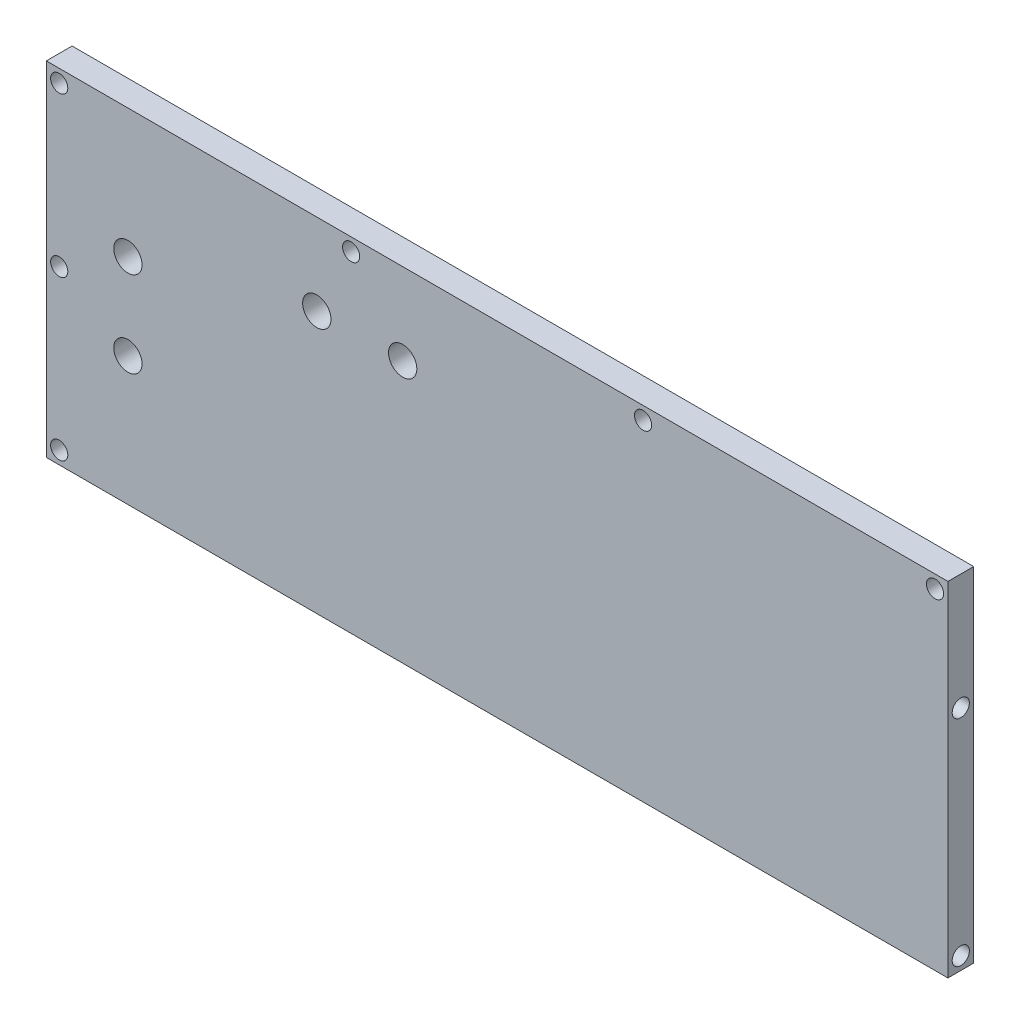
ISO-10303-21;
HEADER;
FILE_DESCRIPTION(('STEP AP214'),'2;1');
FILE_NAME('part.step','',(''),(''),'','','');
FILE_SCHEMA(('AUTOMOTIVE_DESIGN { 1 0 10303 214 1 1 1 1 }'));
ENDSEC;
DATA;
#1=APPLICATION_CONTEXT('core data for automotive mechanical design processes');
#2=APPLICATION_PROTOCOL_DEFINITION('international standard','automotive_design',2000,#1);
#3=PRODUCT_CONTEXT('',#1,'mechanical');
#4=PRODUCT('Part','Part','',(#3));
#5=PRODUCT_RELATED_PRODUCT_CATEGORY('part','',(#4));
#6=PRODUCT_DEFINITION_FORMATION('','',#4);
#7=PRODUCT_DEFINITION_CONTEXT('part definition',#1,'design');
#8=PRODUCT_DEFINITION('design','',#6,#7);
#9=PRODUCT_DEFINITION_SHAPE('','',#8);
#10=(LENGTH_UNIT() NAMED_UNIT(*) SI_UNIT(.MILLI.,.METRE.));
#11=(NAMED_UNIT(*) PLANE_ANGLE_UNIT() SI_UNIT($,.RADIAN.));
#12=(NAMED_UNIT(*) SI_UNIT($,.STERADIAN.) SOLID_ANGLE_UNIT());
#13=UNCERTAINTY_MEASURE_WITH_UNIT(LENGTH_MEASURE(1.E-05),#10,'distance_accuracy_value','');
#14=(GEOMETRIC_REPRESENTATION_CONTEXT(3) GLOBAL_UNCERTAINTY_ASSIGNED_CONTEXT((#13)) GLOBAL_UNIT_ASSIGNED_CONTEXT((#10,
#11,#12)) REPRESENTATION_CONTEXT('',''));
#15=CARTESIAN_POINT('',(0.,0.,0.));
#16=DIRECTION('',(0.,0.,1.));
#17=DIRECTION('',(1.,0.,0.));
#18=AXIS2_PLACEMENT_3D('',#15,#16,#17);
#19=CARTESIAN_POINT('',(-105.,-40.,6.));
#20=DIRECTION('',(1.,0.,0.));
#21=DIRECTION('',(0.,0.,-1.));
#22=AXIS2_PLACEMENT_3D('',#19,#20,#21);
#23=PLANE('',#22);
#24=DIRECTION('',(0.,-1.,0.));
#25=VECTOR('',#24,1.);
#26=CARTESIAN_POINT('',(-105.,-40.,0.));
#27=LINE('',#26,#25);
#28=CARTESIAN_POINT('',(-105.,40.,0.));
#29=VERTEX_POINT('',#28);
#30=CARTESIAN_POINT('',(-105.,-40.,0.));
#31=VERTEX_POINT('',#30);
#32=EDGE_CURVE('E100',#29,#31,#27,.T.);
#33=ORIENTED_EDGE('',*,*,#32,.T.);
#34=DIRECTION('',(0.,0.,-1.));
#35=VECTOR('',#34,1.);
#36=CARTESIAN_POINT('',(-105.,-40.,6.));
#37=LINE('',#36,#35);
#38=CARTESIAN_POINT('',(-105.,-40.,6.));
#39=VERTEX_POINT('',#38);
#40=EDGE_CURVE('E11',#39,#31,#37,.T.);
#41=ORIENTED_EDGE('',*,*,#40,.F.);
#42=DIRECTION('',(0.,-1.,0.));
#43=VECTOR('',#42,1.);
#44=CARTESIAN_POINT('',(-105.,-40.,6.));
#45=LINE('',#44,#43);
#46=CARTESIAN_POINT('',(-105.,40.,6.));
#47=VERTEX_POINT('',#46);
#48=EDGE_CURVE('E87',#47,#39,#45,.T.);
#49=ORIENTED_EDGE('',*,*,#48,.F.);
#50=DIRECTION('',(0.,0.,-1.));
#51=VECTOR('',#50,1.);
#52=CARTESIAN_POINT('',(-105.,40.,6.));
#53=LINE('',#52,#51);
#54=EDGE_CURVE('E96',#47,#29,#53,.T.);
#55=ORIENTED_EDGE('',*,*,#54,.T.);
#56=EDGE_LOOP('',(#33,#41,#49,#55));
#57=FACE_BOUND('',#56,.T.);
#58=ADVANCED_FACE('F34',(#57),#23,.F.);
#59=CARTESIAN_POINT('',(-105.,-40.,6.));
#60=DIRECTION('',(0.,1.,0.));
#61=DIRECTION('',(0.,0.,1.));
#62=AXIS2_PLACEMENT_3D('',#59,#60,#61);
#63=PLANE('',#62);
#64=DIRECTION('',(1.,0.,0.));
#65=VECTOR('',#64,1.);
#66=CARTESIAN_POINT('',(-105.,-40.,0.));
#67=LINE('',#66,#65);
#68=CARTESIAN_POINT('',(105.,-40.,0.));
#69=VERTEX_POINT('',#68);
#70=EDGE_CURVE('E91',#31,#69,#67,.T.);
#71=ORIENTED_EDGE('',*,*,#70,.T.);
#72=DIRECTION('',(0.,0.,-1.));
#73=VECTOR('',#72,1.);
#74=CARTESIAN_POINT('',(105.,-40.,6.));
#75=LINE('',#74,#73);
#76=CARTESIAN_POINT('',(105.,-40.,6.));
#77=VERTEX_POINT('',#76);
#78=EDGE_CURVE('E43',#77,#69,#75,.T.);
#79=ORIENTED_EDGE('',*,*,#78,.F.);
#80=DIRECTION('',(1.,0.,0.));
#81=VECTOR('',#80,1.);
#82=CARTESIAN_POINT('',(-105.,-40.,6.));
#83=LINE('',#82,#81);
#84=EDGE_CURVE('E82',#39,#77,#83,.T.);
#85=ORIENTED_EDGE('',*,*,#84,.F.);
#86=ORIENTED_EDGE('',*,*,#40,.T.);
#87=EDGE_LOOP('',(#71,#79,#85,#86));
#88=FACE_BOUND('',#87,.T.);
#89=ADVANCED_FACE('F90',(#88),#63,.F.);
#90=CARTESIAN_POINT('',(105.,-40.,6.));
#91=DIRECTION('',(-1.,0.,0.));
#92=DIRECTION('',(0.,-1.,0.));
#93=AXIS2_PLACEMENT_3D('',#90,#91,#92);
#94=PLANE('',#93);
#95=CARTESIAN_POINT('',(105.,13.,3.));
#96=DIRECTION('',(1.,0.,0.));
#97=DIRECTION('',(0.,1.,0.));
#98=AXIS2_PLACEMENT_3D('',#95,#96,#97);
#99=CIRCLE('',#98,2.);
#100=CARTESIAN_POINT('',(105.,15.,3.));
#101=VERTEX_POINT('',#100);
#102=EDGE_CURVE('E112',#101,#101,#99,.T.);
#103=ORIENTED_EDGE('',*,*,#102,.F.);
#104=EDGE_LOOP('',(#103));
#105=FACE_BOUND('',#104,.T.);
#106=CARTESIAN_POINT('',(105.,-37.,3.));
#107=DIRECTION('',(1.,0.,0.));
#108=DIRECTION('',(0.,1.,0.));
#109=AXIS2_PLACEMENT_3D('',#106,#107,#108);
#110=CIRCLE('',#109,2.);
#111=CARTESIAN_POINT('',(105.,-35.,3.));
#112=VERTEX_POINT('',#111);
#113=EDGE_CURVE('E137',#112,#112,#110,.T.);
#114=ORIENTED_EDGE('',*,*,#113,.F.);
#115=EDGE_LOOP('',(#114));
#116=FACE_BOUND('',#115,.T.);
#117=DIRECTION('',(0.,1.,0.));
#118=VECTOR('',#117,1.);
#119=CARTESIAN_POINT('',(105.,-40.,0.));
#120=LINE('',#119,#118);
#121=CARTESIAN_POINT('',(105.,40.,0.));
#122=VERTEX_POINT('',#121);
#123=EDGE_CURVE('E69',#69,#122,#120,.T.);
#124=ORIENTED_EDGE('',*,*,#123,.T.);
#125=DIRECTION('',(0.,0.,-1.));
#126=VECTOR('',#125,1.);
#127=CARTESIAN_POINT('',(105.,40.,6.));
#128=LINE('',#127,#126);
#129=CARTESIAN_POINT('',(105.,40.,6.));
#130=VERTEX_POINT('',#129);
#131=EDGE_CURVE('E92',#130,#122,#128,.T.);
#132=ORIENTED_EDGE('',*,*,#131,.F.);
#133=DIRECTION('',(0.,1.,0.));
#134=VECTOR('',#133,1.);
#135=CARTESIAN_POINT('',(105.,-40.,6.));
#136=LINE('',#135,#134);
#137=EDGE_CURVE('E85',#77,#130,#136,.T.);
#138=ORIENTED_EDGE('',*,*,#137,.F.);
#139=ORIENTED_EDGE('',*,*,#78,.T.);
#140=EDGE_LOOP('',(#124,#132,#138,#139));
#141=FACE_BOUND('',#140,.T.);
#142=ADVANCED_FACE('F94',(#105,#116,#141),#94,.F.);
#143=CARTESIAN_POINT('',(-105.,40.,6.));
#144=DIRECTION('',(0.,-1.,0.));
#145=DIRECTION('',(0.,0.,-1.));
#146=AXIS2_PLACEMENT_3D('',#143,#144,#145);
#147=PLANE('',#146);
#148=DIRECTION('',(-1.,0.,0.));
#149=VECTOR('',#148,1.);
#150=CARTESIAN_POINT('',(-105.,40.,0.));
#151=LINE('',#150,#149);
#152=EDGE_CURVE('E75',#122,#29,#151,.T.);
#153=ORIENTED_EDGE('',*,*,#152,.T.);
#154=ORIENTED_EDGE('',*,*,#54,.F.);
#155=DIRECTION('',(-1.,0.,0.));
#156=VECTOR('',#155,1.);
#157=CARTESIAN_POINT('',(-105.,40.,6.));
#158=LINE('',#157,#156);
#159=EDGE_CURVE('E52',#130,#47,#158,.T.);
#160=ORIENTED_EDGE('',*,*,#159,.F.);
#161=ORIENTED_EDGE('',*,*,#131,.T.);
#162=EDGE_LOOP('',(#153,#154,#160,#161));
#163=FACE_BOUND('',#162,.T.);
#164=ADVANCED_FACE('F185',(#163),#147,.F.);
#165=CARTESIAN_POINT('',(0.,0.,6.));
#166=DIRECTION('',(0.,0.,-1.));
#167=DIRECTION('',(-1.,0.,0.));
#168=AXIS2_PLACEMENT_3D('',#165,#166,#167);
#169=PLANE('',#168);
#170=CARTESIAN_POINT('',(-22.,21.,6.));
#171=DIRECTION('',(0.,0.,1.));
#172=DIRECTION('',(-1.,0.,0.));
#173=AXIS2_PLACEMENT_3D('',#170,#171,#172);
#174=CIRCLE('',#173,3.3);
#175=CARTESIAN_POINT('',(-25.3,21.,6.));
#176=VERTEX_POINT('',#175);
#177=EDGE_CURVE('E129',#176,#176,#174,.T.);
#178=ORIENTED_EDGE('',*,*,#177,.F.);
#179=EDGE_LOOP('',(#178));
#180=FACE_BOUND('',#179,.T.);
#181=CARTESIAN_POINT('',(-42.,21.,6.));
#182=DIRECTION('',(0.,0.,1.));
#183=DIRECTION('',(1.,0.,0.));
#184=AXIS2_PLACEMENT_3D('',#181,#182,#183);
#185=CIRCLE('',#184,3.3);
#186=CARTESIAN_POINT('',(-38.7,21.,6.));
#187=VERTEX_POINT('',#186);
#188=EDGE_CURVE('E119',#187,#187,#185,.T.);
#189=ORIENTED_EDGE('',*,*,#188,.F.);
#190=EDGE_LOOP('',(#189));
#191=FACE_BOUND('',#190,.T.);
#192=CARTESIAN_POINT('',(-86.,-10.,6.));
#193=DIRECTION('',(0.,0.,1.));
#194=DIRECTION('',(-1.,0.,0.));
#195=AXIS2_PLACEMENT_3D('',#192,#193,#194);
#196=CIRCLE('',#195,3.30000000000001);
#197=CARTESIAN_POINT('',(-89.3,-10.,6.));
#198=VERTEX_POINT('',#197);
#199=EDGE_CURVE('E116',#198,#198,#196,.T.);
#200=ORIENTED_EDGE('',*,*,#199,.F.);
#201=EDGE_LOOP('',(#200));
#202=FACE_BOUND('',#201,.T.);
#203=CARTESIAN_POINT('',(-86.,9.99999999999999,6.));
#204=DIRECTION('',(0.,0.,1.));
#205=DIRECTION('',(1.,0.,0.));
#206=AXIS2_PLACEMENT_3D('',#203,#204,#205);
#207=CIRCLE('',#206,3.30000000000001);
#208=CARTESIAN_POINT('',(-82.7,9.99999999999999,6.));
#209=VERTEX_POINT('',#208);
#210=EDGE_CURVE('E113',#209,#209,#207,.T.);
#211=ORIENTED_EDGE('',*,*,#210,.F.);
#212=EDGE_LOOP('',(#211));
#213=FACE_BOUND('',#212,.T.);
#214=CARTESIAN_POINT('',(102.,37.,6.));
#215=DIRECTION('',(0.,0.,1.));
#216=DIRECTION('',(1.,0.,0.));
#217=AXIS2_PLACEMENT_3D('',#214,#215,#216);
#218=CIRCLE('',#217,2.);
#219=CARTESIAN_POINT('',(104.,37.,6.));
#220=VERTEX_POINT('',#219);
#221=EDGE_CURVE('E143',#220,#220,#218,.T.);
#222=ORIENTED_EDGE('',*,*,#221,.F.);
#223=EDGE_LOOP('',(#222));
#224=FACE_BOUND('',#223,.T.);
#225=CARTESIAN_POINT('',(34.,37.,6.));
#226=DIRECTION('',(0.,0.,1.));
#227=DIRECTION('',(1.,0.,0.));
#228=AXIS2_PLACEMENT_3D('',#225,#226,#227);
#229=CIRCLE('',#228,2.);
#230=CARTESIAN_POINT('',(36.,37.,6.));
#231=VERTEX_POINT('',#230);
#232=EDGE_CURVE('E149',#231,#231,#229,.T.);
#233=ORIENTED_EDGE('',*,*,#232,.F.);
#234=EDGE_LOOP('',(#233));
#235=FACE_BOUND('',#234,.T.);
#236=CARTESIAN_POINT('',(-34.,37.,6.));
#237=DIRECTION('',(0.,0.,1.));
#238=DIRECTION('',(1.,0.,0.));
#239=AXIS2_PLACEMENT_3D('',#236,#237,#238);
#240=CIRCLE('',#239,2.);
#241=CARTESIAN_POINT('',(-32.,37.,6.));
#242=VERTEX_POINT('',#241);
#243=EDGE_CURVE('E155',#242,#242,#240,.T.);
#244=ORIENTED_EDGE('',*,*,#243,.F.);
#245=EDGE_LOOP('',(#244));
#246=FACE_BOUND('',#245,.T.);
#247=CARTESIAN_POINT('',(-102.,-37.,6.));
#248=DIRECTION('',(0.,0.,1.));
#249=DIRECTION('',(-1.,0.,0.));
#250=AXIS2_PLACEMENT_3D('',#247,#248,#249);
#251=CIRCLE('',#250,2.);
#252=CARTESIAN_POINT('',(-104.,-37.,6.));
#253=VERTEX_POINT('',#252);
#254=EDGE_CURVE('E161',#253,#253,#251,.T.);
#255=ORIENTED_EDGE('',*,*,#254,.F.);
#256=EDGE_LOOP('',(#255));
#257=FACE_BOUND('',#256,.T.);
#258=CARTESIAN_POINT('',(-102.,37.,6.));
#259=DIRECTION('',(0.,0.,1.));
#260=DIRECTION('',(1.,0.,0.));
#261=AXIS2_PLACEMENT_3D('',#258,#259,#260);
#262=CIRCLE('',#261,2.);
#263=CARTESIAN_POINT('',(-100.,37.,6.));
#264=VERTEX_POINT('',#263);
#265=EDGE_CURVE('E167',#264,#264,#262,.T.);
#266=ORIENTED_EDGE('',*,*,#265,.F.);
#267=EDGE_LOOP('',(#266));
#268=FACE_BOUND('',#267,.T.);
#269=CARTESIAN_POINT('',(-102.,0.,6.));
#270=DIRECTION('',(0.,0.,1.));
#271=DIRECTION('',(1.,0.,0.));
#272=AXIS2_PLACEMENT_3D('',#269,#270,#271);
#273=CIRCLE('',#272,2.);
#274=CARTESIAN_POINT('',(-100.,0.,6.));
#275=VERTEX_POINT('',#274);
#276=EDGE_CURVE('E173',#275,#275,#273,.T.);
#277=ORIENTED_EDGE('',*,*,#276,.F.);
#278=EDGE_LOOP('',(#277));
#279=FACE_BOUND('',#278,.T.);
#280=ORIENTED_EDGE('',*,*,#48,.T.);
#281=ORIENTED_EDGE('',*,*,#84,.T.);
#282=ORIENTED_EDGE('',*,*,#137,.T.);
#283=ORIENTED_EDGE('',*,*,#159,.T.);
#284=EDGE_LOOP('',(#280,#281,#282,#283));
#285=FACE_BOUND('',#284,.T.);
#286=ADVANCED_FACE('F83',(#180,#191,#202,#213,#224,#235,#246,#257,#268,#279,#285),#169,.F.);
#287=CARTESIAN_POINT('',(0.,0.,0.));
#288=DIRECTION('',(0.,0.,-1.));
#289=DIRECTION('',(-1.,0.,0.));
#290=AXIS2_PLACEMENT_3D('',#287,#288,#289);
#291=PLANE('',#290);
#292=CARTESIAN_POINT('',(-22.,21.,0.));
#293=DIRECTION('',(0.,0.,-1.));
#294=DIRECTION('',(-1.,0.,0.));
#295=AXIS2_PLACEMENT_3D('',#292,#293,#294);
#296=CIRCLE('',#295,3.3);
#297=CARTESIAN_POINT('',(-25.3,21.,0.));
#298=VERTEX_POINT('',#297);
#299=EDGE_CURVE('E37',#298,#298,#296,.T.);
#300=ORIENTED_EDGE('',*,*,#299,.F.);
#301=EDGE_LOOP('',(#300));
#302=FACE_BOUND('',#301,.T.);
#303=CARTESIAN_POINT('',(-42.,21.,0.));
#304=DIRECTION('',(0.,0.,-1.));
#305=DIRECTION('',(-1.,0.,0.));
#306=AXIS2_PLACEMENT_3D('',#303,#304,#305);
#307=CIRCLE('',#306,3.3);
#308=CARTESIAN_POINT('',(-45.3,21.,0.));
#309=VERTEX_POINT('',#308);
#310=EDGE_CURVE('E117',#309,#309,#307,.T.);
#311=ORIENTED_EDGE('',*,*,#310,.F.);
#312=EDGE_LOOP('',(#311));
#313=FACE_BOUND('',#312,.T.);
#314=CARTESIAN_POINT('',(-86.,-10.,0.));
#315=DIRECTION('',(0.,0.,-1.));
#316=DIRECTION('',(-1.,0.,0.));
#317=AXIS2_PLACEMENT_3D('',#314,#315,#316);
#318=CIRCLE('',#317,3.30000000000001);
#319=CARTESIAN_POINT('',(-89.3,-10.,0.));
#320=VERTEX_POINT('',#319);
#321=EDGE_CURVE('E114',#320,#320,#318,.T.);
#322=ORIENTED_EDGE('',*,*,#321,.F.);
#323=EDGE_LOOP('',(#322));
#324=FACE_BOUND('',#323,.T.);
#325=CARTESIAN_POINT('',(-86.,9.99999999999999,0.));
#326=DIRECTION('',(0.,0.,-1.));
#327=DIRECTION('',(-1.,0.,0.));
#328=AXIS2_PLACEMENT_3D('',#325,#326,#327);
#329=CIRCLE('',#328,3.30000000000001);
#330=CARTESIAN_POINT('',(-89.3,9.99999999999999,0.));
#331=VERTEX_POINT('',#330);
#332=EDGE_CURVE('E109',#331,#331,#329,.T.);
#333=ORIENTED_EDGE('',*,*,#332,.F.);
#334=EDGE_LOOP('',(#333));
#335=FACE_BOUND('',#334,.T.);
#336=CARTESIAN_POINT('',(102.,37.,0.));
#337=DIRECTION('',(0.,0.,1.));
#338=DIRECTION('',(1.,0.,0.));
#339=AXIS2_PLACEMENT_3D('',#336,#337,#338);
#340=CIRCLE('',#339,2.);
#341=CARTESIAN_POINT('',(104.,37.,0.));
#342=VERTEX_POINT('',#341);
#343=EDGE_CURVE('E146',#342,#342,#340,.T.);
#344=ORIENTED_EDGE('',*,*,#343,.T.);
#345=EDGE_LOOP('',(#344));
#346=FACE_BOUND('',#345,.T.);
#347=CARTESIAN_POINT('',(34.,37.,0.));
#348=DIRECTION('',(0.,0.,1.));
#349=DIRECTION('',(1.,0.,0.));
#350=AXIS2_PLACEMENT_3D('',#347,#348,#349);
#351=CIRCLE('',#350,2.);
#352=CARTESIAN_POINT('',(36.,37.,0.));
#353=VERTEX_POINT('',#352);
#354=EDGE_CURVE('E152',#353,#353,#351,.T.);
#355=ORIENTED_EDGE('',*,*,#354,.T.);
#356=EDGE_LOOP('',(#355));
#357=FACE_BOUND('',#356,.T.);
#358=CARTESIAN_POINT('',(-34.,37.,0.));
#359=DIRECTION('',(0.,0.,1.));
#360=DIRECTION('',(1.,0.,0.));
#361=AXIS2_PLACEMENT_3D('',#358,#359,#360);
#362=CIRCLE('',#361,2.);
#363=CARTESIAN_POINT('',(-32.,37.,0.));
#364=VERTEX_POINT('',#363);
#365=EDGE_CURVE('E158',#364,#364,#362,.T.);
#366=ORIENTED_EDGE('',*,*,#365,.T.);
#367=EDGE_LOOP('',(#366));
#368=FACE_BOUND('',#367,.T.);
#369=CARTESIAN_POINT('',(-102.,-37.,0.));
#370=DIRECTION('',(0.,0.,1.));
#371=DIRECTION('',(-1.,0.,0.));
#372=AXIS2_PLACEMENT_3D('',#369,#370,#371);
#373=CIRCLE('',#372,2.);
#374=CARTESIAN_POINT('',(-104.,-37.,0.));
#375=VERTEX_POINT('',#374);
#376=EDGE_CURVE('E164',#375,#375,#373,.T.);
#377=ORIENTED_EDGE('',*,*,#376,.T.);
#378=EDGE_LOOP('',(#377));
#379=FACE_BOUND('',#378,.T.);
#380=CARTESIAN_POINT('',(-102.,37.,0.));
#381=DIRECTION('',(0.,0.,1.));
#382=DIRECTION('',(1.,0.,0.));
#383=AXIS2_PLACEMENT_3D('',#380,#381,#382);
#384=CIRCLE('',#383,2.);
#385=CARTESIAN_POINT('',(-100.,37.,0.));
#386=VERTEX_POINT('',#385);
#387=EDGE_CURVE('E170',#386,#386,#384,.T.);
#388=ORIENTED_EDGE('',*,*,#387,.T.);
#389=EDGE_LOOP('',(#388));
#390=FACE_BOUND('',#389,.T.);
#391=CARTESIAN_POINT('',(-102.,0.,0.));
#392=DIRECTION('',(0.,0.,1.));
#393=DIRECTION('',(1.,0.,0.));
#394=AXIS2_PLACEMENT_3D('',#391,#392,#393);
#395=CIRCLE('',#394,2.);
#396=CARTESIAN_POINT('',(-100.,0.,0.));
#397=VERTEX_POINT('',#396);
#398=EDGE_CURVE('E103',#397,#397,#395,.T.);
#399=ORIENTED_EDGE('',*,*,#398,.T.);
#400=EDGE_LOOP('',(#399));
#401=FACE_BOUND('',#400,.T.);
#402=ORIENTED_EDGE('',*,*,#32,.F.);
#403=ORIENTED_EDGE('',*,*,#152,.F.);
#404=ORIENTED_EDGE('',*,*,#123,.F.);
#405=ORIENTED_EDGE('',*,*,#70,.F.);
#406=EDGE_LOOP('',(#402,#403,#404,#405));
#407=FACE_BOUND('',#406,.T.);
#408=ADVANCED_FACE('F184',(#302,#313,#324,#335,#346,#357,#368,#379,#390,#401,#407),#291,.T.);
#409=CARTESIAN_POINT('',(-102.,0.,0.));
#410=DIRECTION('',(0.,0.,1.));
#411=DIRECTION('',(1.,0.,0.));
#412=AXIS2_PLACEMENT_3D('',#409,#410,#411);
#413=CYLINDRICAL_SURFACE('',#412,2.);
#414=ORIENTED_EDGE('',*,*,#398,.F.);
#415=EDGE_LOOP('',(#414));
#416=FACE_BOUND('',#415,.T.);
#417=ORIENTED_EDGE('',*,*,#276,.T.);
#418=EDGE_LOOP('',(#417));
#419=FACE_BOUND('',#418,.T.);
#420=ADVANCED_FACE('F181',(#416,#419),#413,.F.);
#421=CARTESIAN_POINT('',(-102.,37.,0.));
#422=DIRECTION('',(0.,0.,1.));
#423=DIRECTION('',(1.,0.,0.));
#424=AXIS2_PLACEMENT_3D('',#421,#422,#423);
#425=CYLINDRICAL_SURFACE('',#424,2.);
#426=ORIENTED_EDGE('',*,*,#387,.F.);
#427=EDGE_LOOP('',(#426));
#428=FACE_BOUND('',#427,.T.);
#429=ORIENTED_EDGE('',*,*,#265,.T.);
#430=EDGE_LOOP('',(#429));
#431=FACE_BOUND('',#430,.T.);
#432=ADVANCED_FACE('F245',(#428,#431),#425,.F.);
#433=CARTESIAN_POINT('',(-102.,-37.,0.));
#434=DIRECTION('',(0.,0.,1.));
#435=DIRECTION('',(1.,0.,0.));
#436=AXIS2_PLACEMENT_3D('',#433,#434,#435);
#437=CYLINDRICAL_SURFACE('',#436,2.);
#438=ORIENTED_EDGE('',*,*,#376,.F.);
#439=EDGE_LOOP('',(#438));
#440=FACE_BOUND('',#439,.T.);
#441=ORIENTED_EDGE('',*,*,#254,.T.);
#442=EDGE_LOOP('',(#441));
#443=FACE_BOUND('',#442,.T.);
#444=ADVANCED_FACE('F241',(#440,#443),#437,.F.);
#445=CARTESIAN_POINT('',(-34.,37.,0.));
#446=DIRECTION('',(0.,0.,1.));
#447=DIRECTION('',(1.,0.,0.));
#448=AXIS2_PLACEMENT_3D('',#445,#446,#447);
#449=CYLINDRICAL_SURFACE('',#448,2.);
#450=ORIENTED_EDGE('',*,*,#365,.F.);
#451=EDGE_LOOP('',(#450));
#452=FACE_BOUND('',#451,.T.);
#453=ORIENTED_EDGE('',*,*,#243,.T.);
#454=EDGE_LOOP('',(#453));
#455=FACE_BOUND('',#454,.T.);
#456=ADVANCED_FACE('F237',(#452,#455),#449,.F.);
#457=CARTESIAN_POINT('',(34.,37.,0.));
#458=DIRECTION('',(0.,0.,1.));
#459=DIRECTION('',(1.,0.,0.));
#460=AXIS2_PLACEMENT_3D('',#457,#458,#459);
#461=CYLINDRICAL_SURFACE('',#460,2.);
#462=ORIENTED_EDGE('',*,*,#354,.F.);
#463=EDGE_LOOP('',(#462));
#464=FACE_BOUND('',#463,.T.);
#465=ORIENTED_EDGE('',*,*,#232,.T.);
#466=EDGE_LOOP('',(#465));
#467=FACE_BOUND('',#466,.T.);
#468=ADVANCED_FACE('F229',(#464,#467),#461,.F.);
#469=CARTESIAN_POINT('',(102.,37.,0.));
#470=DIRECTION('',(0.,0.,1.));
#471=DIRECTION('',(1.,0.,0.));
#472=AXIS2_PLACEMENT_3D('',#469,#470,#471);
#473=CYLINDRICAL_SURFACE('',#472,2.);
#474=ORIENTED_EDGE('',*,*,#343,.F.);
#475=EDGE_LOOP('',(#474));
#476=FACE_BOUND('',#475,.T.);
#477=ORIENTED_EDGE('',*,*,#221,.T.);
#478=EDGE_LOOP('',(#477));
#479=FACE_BOUND('',#478,.T.);
#480=ADVANCED_FACE('F219',(#476,#479),#473,.F.);
#481=CARTESIAN_POINT('',(85.,-37.,3.));
#482=DIRECTION('',(1.,0.,0.));
#483=DIRECTION('',(0.,1.,0.));
#484=AXIS2_PLACEMENT_3D('',#481,#482,#483);
#485=CYLINDRICAL_SURFACE('',#484,2.);
#486=CARTESIAN_POINT('',(85.,-37.,3.));
#487=DIRECTION('',(1.,0.,0.));
#488=DIRECTION('',(0.,1.,0.));
#489=AXIS2_PLACEMENT_3D('',#486,#487,#488);
#490=CIRCLE('',#489,2.);
#491=CARTESIAN_POINT('',(85.,-35.,3.));
#492=VERTEX_POINT('',#491);
#493=EDGE_CURVE('E140',#492,#492,#490,.T.);
#494=ORIENTED_EDGE('',*,*,#493,.F.);
#495=EDGE_LOOP('',(#494));
#496=FACE_BOUND('',#495,.T.);
#497=ORIENTED_EDGE('',*,*,#113,.T.);
#498=EDGE_LOOP('',(#497));
#499=FACE_BOUND('',#498,.T.);
#500=ADVANCED_FACE('F216',(#496,#499),#485,.F.);
#501=CARTESIAN_POINT('',(85.,-37.,3.));
#502=DIRECTION('',(1.,0.,0.));
#503=DIRECTION('',(0.,1.,0.));
#504=AXIS2_PLACEMENT_3D('',#501,#502,#503);
#505=PLANE('',#504);
#506=ORIENTED_EDGE('',*,*,#493,.T.);
#507=EDGE_LOOP('',(#506));
#508=FACE_BOUND('',#507,.T.);
#509=ADVANCED_FACE('F218',(#508),#505,.T.);
#510=CARTESIAN_POINT('',(85.,13.,3.));
#511=DIRECTION('',(1.,0.,0.));
#512=DIRECTION('',(0.,1.,0.));
#513=AXIS2_PLACEMENT_3D('',#510,#511,#512);
#514=CYLINDRICAL_SURFACE('',#513,2.);
#515=CARTESIAN_POINT('',(85.,13.,3.));
#516=DIRECTION('',(1.,0.,0.));
#517=DIRECTION('',(0.,1.,0.));
#518=AXIS2_PLACEMENT_3D('',#515,#516,#517);
#519=CIRCLE('',#518,2.);
#520=CARTESIAN_POINT('',(85.,15.,3.));
#521=VERTEX_POINT('',#520);
#522=EDGE_CURVE('E134',#521,#521,#519,.T.);
#523=ORIENTED_EDGE('',*,*,#522,.F.);
#524=EDGE_LOOP('',(#523));
#525=FACE_BOUND('',#524,.T.);
#526=ORIENTED_EDGE('',*,*,#102,.T.);
#527=EDGE_LOOP('',(#526));
#528=FACE_BOUND('',#527,.T.);
#529=ADVANCED_FACE('F226',(#525,#528),#514,.F.);
#530=CARTESIAN_POINT('',(85.,13.,3.));
#531=DIRECTION('',(1.,0.,0.));
#532=DIRECTION('',(0.,1.,0.));
#533=AXIS2_PLACEMENT_3D('',#530,#531,#532);
#534=PLANE('',#533);
#535=ORIENTED_EDGE('',*,*,#522,.T.);
#536=EDGE_LOOP('',(#535));
#537=FACE_BOUND('',#536,.T.);
#538=ADVANCED_FACE('F303',(#537),#534,.T.);
#539=CARTESIAN_POINT('',(-86.,9.99999999999999,-4.));
#540=DIRECTION('',(0.,0.,1.));
#541=DIRECTION('',(1.,0.,0.));
#542=AXIS2_PLACEMENT_3D('',#539,#540,#541);
#543=CYLINDRICAL_SURFACE('',#542,3.30000000000001);
#544=ORIENTED_EDGE('',*,*,#332,.T.);
#545=EDGE_LOOP('',(#544));
#546=FACE_BOUND('',#545,.T.);
#547=ORIENTED_EDGE('',*,*,#210,.T.);
#548=EDGE_LOOP('',(#547));
#549=FACE_BOUND('',#548,.T.);
#550=ADVANCED_FACE('F312',(#546,#549),#543,.F.);
#551=CARTESIAN_POINT('',(-86.,-10.,-4.));
#552=DIRECTION('',(0.,0.,1.));
#553=DIRECTION('',(1.,0.,0.));
#554=AXIS2_PLACEMENT_3D('',#551,#552,#553);
#555=CYLINDRICAL_SURFACE('',#554,3.30000000000001);
#556=ORIENTED_EDGE('',*,*,#321,.T.);
#557=EDGE_LOOP('',(#556));
#558=FACE_BOUND('',#557,.T.);
#559=ORIENTED_EDGE('',*,*,#199,.T.);
#560=EDGE_LOOP('',(#559));
#561=FACE_BOUND('',#560,.T.);
#562=ADVANCED_FACE('F322',(#558,#561),#555,.F.);
#563=CARTESIAN_POINT('',(-42.,21.,-4.));
#564=DIRECTION('',(0.,0.,1.));
#565=DIRECTION('',(1.,0.,0.));
#566=AXIS2_PLACEMENT_3D('',#563,#564,#565);
#567=CYLINDRICAL_SURFACE('',#566,3.3);
#568=ORIENTED_EDGE('',*,*,#310,.T.);
#569=EDGE_LOOP('',(#568));
#570=FACE_BOUND('',#569,.T.);
#571=ORIENTED_EDGE('',*,*,#188,.T.);
#572=EDGE_LOOP('',(#571));
#573=FACE_BOUND('',#572,.T.);
#574=ADVANCED_FACE('F331',(#570,#573),#567,.F.);
#575=CARTESIAN_POINT('',(-22.,21.,-4.));
#576=DIRECTION('',(0.,0.,1.));
#577=DIRECTION('',(1.,0.,0.));
#578=AXIS2_PLACEMENT_3D('',#575,#576,#577);
#579=CYLINDRICAL_SURFACE('',#578,3.3);
#580=ORIENTED_EDGE('',*,*,#299,.T.);
#581=EDGE_LOOP('',(#580));
#582=FACE_BOUND('',#581,.T.);
#583=ORIENTED_EDGE('',*,*,#177,.T.);
#584=EDGE_LOOP('',(#583));
#585=FACE_BOUND('',#584,.T.);
#586=ADVANCED_FACE('F350',(#582,#585),#579,.F.);
#587=CLOSED_SHELL('',(#58,#89,#142,#164,#286,#408,#420,#432,#444,#456,#468,#480,#500,#509,#529,
#538,#550,#562,#574,#586));
#588=MANIFOLD_SOLID_BREP('B2',#587);
#589=ADVANCED_BREP_SHAPE_REPRESENTATION('',(#18,#588),#14);
#590=SHAPE_DEFINITION_REPRESENTATION(#9,#589);
ENDSEC;
END-ISO-10303-21;
